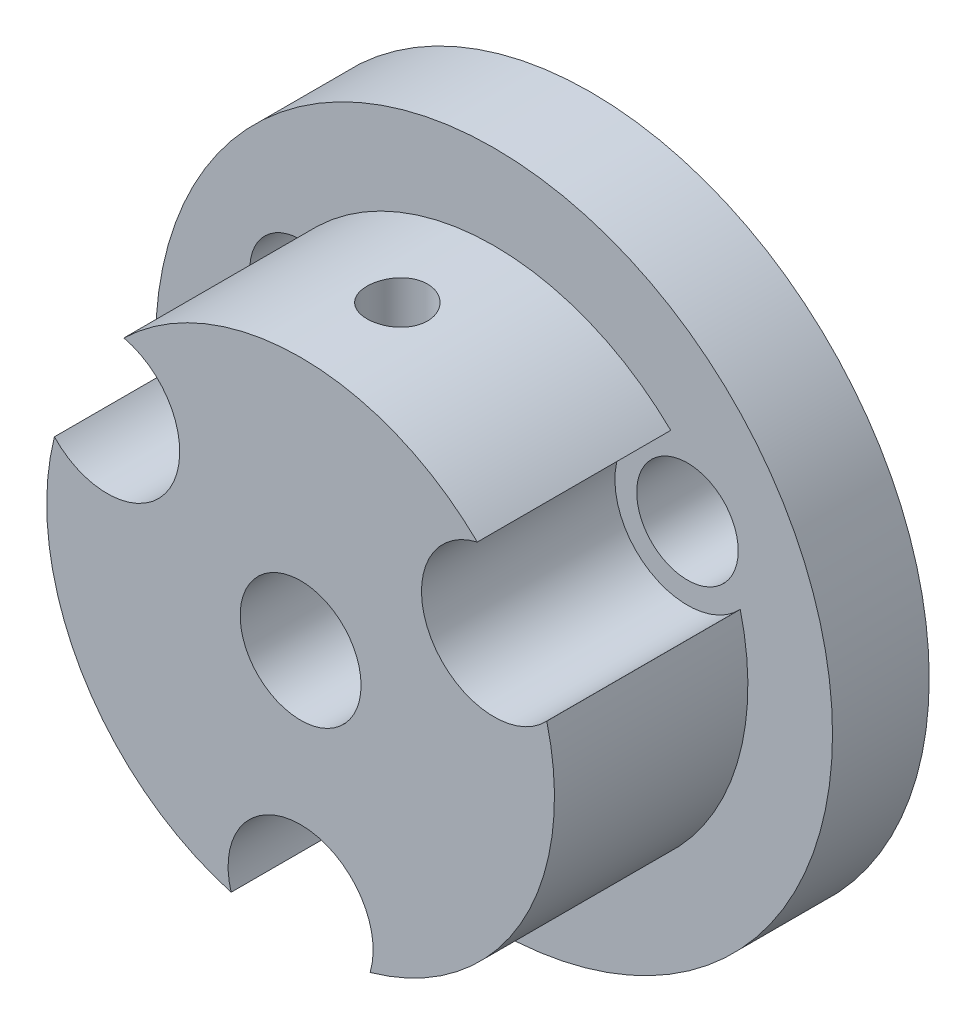
ISO-10303-21;
HEADER;
FILE_DESCRIPTION(('STEP AP214'),'2;1');
FILE_NAME('part.step','',(''),(''),'','','');
FILE_SCHEMA(('AUTOMOTIVE_DESIGN { 1 0 10303 214 1 1 1 1 }'));
ENDSEC;
DATA;
#1=APPLICATION_CONTEXT('core data for automotive mechanical design processes');
#2=APPLICATION_PROTOCOL_DEFINITION('international standard','automotive_design',2000,#1);
#3=PRODUCT_CONTEXT('',#1,'mechanical');
#4=PRODUCT('Part','Part','',(#3));
#5=PRODUCT_RELATED_PRODUCT_CATEGORY('part','',(#4));
#6=PRODUCT_DEFINITION_FORMATION('','',#4);
#7=PRODUCT_DEFINITION_CONTEXT('part definition',#1,'design');
#8=PRODUCT_DEFINITION('design','',#6,#7);
#9=PRODUCT_DEFINITION_SHAPE('','',#8);
#10=(LENGTH_UNIT() NAMED_UNIT(*) SI_UNIT(.MILLI.,.METRE.));
#11=(NAMED_UNIT(*) PLANE_ANGLE_UNIT() SI_UNIT($,.RADIAN.));
#12=(NAMED_UNIT(*) SI_UNIT($,.STERADIAN.) SOLID_ANGLE_UNIT());
#13=UNCERTAINTY_MEASURE_WITH_UNIT(LENGTH_MEASURE(1.E-05),#10,'distance_accuracy_value','');
#14=(GEOMETRIC_REPRESENTATION_CONTEXT(3) GLOBAL_UNCERTAINTY_ASSIGNED_CONTEXT((#13)) GLOBAL_UNIT_ASSIGNED_CONTEXT((#10,
#11,#12)) REPRESENTATION_CONTEXT('',''));
#15=CARTESIAN_POINT('',(0.,0.,0.));
#16=DIRECTION('',(0.,0.,1.));
#17=DIRECTION('',(1.,0.,0.));
#18=AXIS2_PLACEMENT_3D('',#15,#16,#17);
#19=CARTESIAN_POINT('',(0.,0.,12.));
#20=DIRECTION('',(0.,0.,-1.));
#21=DIRECTION('',(-1.,0.,0.));
#22=AXIS2_PLACEMENT_3D('',#19,#20,#21);
#23=CYLINDRICAL_SURFACE('',#22,10.5);
#24=CARTESIAN_POINT('',(0.,10.5,9.25));
#25=CARTESIAN_POINT('',(0.0699475936257036,10.4999990627842,9.24999701239163));
#26=CARTESIAN_POINT('',(0.139939552411775,10.4992936542632,9.24410901234132));
#27=CARTESIAN_POINT('',(0.277977687011594,10.4965474865238,9.22071252218055));
#28=CARTESIAN_POINT('',(0.346021722500156,10.4945053131663,9.20319172566545));
#29=CARTESIAN_POINT('',(0.478145498303041,10.4893157972216,9.15705156614751));
#30=CARTESIAN_POINT('',(0.542227804829418,10.4861691790509,9.12843947675372));
#31=CARTESIAN_POINT('',(0.66466833091937,10.4791212247497,9.0609443902961));
#32=CARTESIAN_POINT('',(0.723027569949896,10.4752200234047,9.02206322706676));
#33=CARTESIAN_POINT('',(0.832670643789314,10.4670769655502,8.9349250617949));
#34=CARTESIAN_POINT('',(0.883921662387477,10.4628336633326,8.8866268992024));
#35=CARTESIAN_POINT('',(0.977610976963137,10.4544963823019,8.78211401318015));
#36=CARTESIAN_POINT('',(1.02004883494707,10.4504024109186,8.72589889652909));
#37=CARTESIAN_POINT('',(1.095028024827,10.442812993205,8.6069363973964));
#38=CARTESIAN_POINT('',(1.12753885630509,10.4393194056245,8.54416966245442));
#39=CARTESIAN_POINT('',(1.18154636106757,10.4333451455293,8.41401897186602));
#40=CARTESIAN_POINT('',(1.20304341409852,10.4308644380919,8.34663517550314));
#41=CARTESIAN_POINT('',(1.2343139770195,10.427210471374,8.20950245156516));
#42=CARTESIAN_POINT('',(1.24414268336783,10.4260310582816,8.13976627731595));
#43=CARTESIAN_POINT('',(1.25196830460063,10.4250943297203,7.99962502717556));
#44=CARTESIAN_POINT('',(1.24996565258353,10.4253369621962,7.92921997586348));
#45=CARTESIAN_POINT('',(1.23423076047667,10.4272112802058,7.79012309974998));
#46=CARTESIAN_POINT('',(1.22055918252446,10.4288357818008,7.72142430221494));
#47=CARTESIAN_POINT('',(1.18196910557829,10.4332795911022,7.58730308522441));
#48=CARTESIAN_POINT('',(1.15705039813801,10.4360989209526,7.52188072651708));
#49=CARTESIAN_POINT('',(1.09660775872499,10.4426229004232,7.39598021422571));
#50=CARTESIAN_POINT('',(1.06105732345842,10.4463297578562,7.33551490347835));
#51=CARTESIAN_POINT('',(0.980379355086877,10.454209380908,7.22138555472782));
#52=CARTESIAN_POINT('',(0.935251424510862,10.4583821658596,7.16772179914041));
#53=CARTESIAN_POINT('',(0.836362613568929,10.4667554375842,7.06836667005418));
#54=CARTESIAN_POINT('',(0.782549419052806,10.4709559341264,7.02272734984492));
#55=CARTESIAN_POINT('',(0.667998156143297,10.4788868274356,6.9411214445485));
#56=CARTESIAN_POINT('',(0.607260074204236,10.482617223283,6.90515487838254));
#57=CARTESIAN_POINT('',(0.480544076472796,10.4891896165517,6.84391595124794));
#58=CARTESIAN_POINT('',(0.414564648499562,10.4920313564109,6.81864668996487));
#59=CARTESIAN_POINT('',(0.279257907490741,10.4965038535979,6.77956017555407));
#60=CARTESIAN_POINT('',(0.209930736672925,10.49813466232,6.76574243639849));
#61=CARTESIAN_POINT('',(0.0703467115396399,10.4999948911042,6.75001829717867));
#62=CARTESIAN_POINT('',(9.8046442172385E-05,10.5002327510227,6.74804015952726));
#63=CARTESIAN_POINT('',(-0.139729786983938,10.4993030290141,6.75586229088874));
#64=CARTESIAN_POINT('',(-0.209308968190918,10.4981354741764,6.76566233287559));
#65=CARTESIAN_POINT('',(-0.345612253176869,10.4945313993079,6.79670305971871));
#66=CARTESIAN_POINT('',(-0.412344218888418,10.4920986563667,6.81790969776851));
#67=CARTESIAN_POINT('',(-0.541304351441906,10.4862367019395,6.87112634657761));
#68=CARTESIAN_POINT('',(-0.603532378350753,10.4828074595098,6.90313669282302));
#69=CARTESIAN_POINT('',(-0.722039619689205,10.475314092816,6.97722678515942));
#70=CARTESIAN_POINT('',(-0.778289517743096,10.4712470619883,7.019353123917));
#71=CARTESIAN_POINT('',(-0.882945896591943,10.4629426023161,7.11241324556918));
#72=CARTESIAN_POINT('',(-0.931352095837293,10.4587051673618,7.16334734448277));
#73=CARTESIAN_POINT('',(-1.01920013053021,10.4505116070986,7.27289239931917));
#74=CARTESIAN_POINT('',(-1.05859453215799,10.4465570423548,7.3315415276793));
#75=CARTESIAN_POINT('',(-1.12697343538891,10.4394021806389,7.45466579676053));
#76=CARTESIAN_POINT('',(-1.1559581291145,10.4362018697466,7.51914082993076));
#77=CARTESIAN_POINT('',(-1.20261737504819,10.4309283013044,7.65193117505654));
#78=CARTESIAN_POINT('',(-1.22031905097623,10.428852342698,7.7202368445951));
#79=CARTESIAN_POINT('',(-1.24399730384296,10.4260546317578,7.85887729984685));
#80=CARTESIAN_POINT('',(-1.24997437162882,10.4253328227328,7.92921200049017));
#81=CARTESIAN_POINT('',(-1.25002530446505,10.4253266782152,8.06944220654871));
#82=CARTESIAN_POINT('',(-1.24417368461885,10.4260333440108,8.1393376962701));
#83=CARTESIAN_POINT('',(-1.22089074117631,10.4287852211255,8.27714444822099));
#84=CARTESIAN_POINT('',(-1.203459412903,10.4308304329852,8.34505570964907));
#85=CARTESIAN_POINT('',(-1.15753447936189,10.4360262503539,8.47695879200294));
#86=CARTESIAN_POINT('',(-1.12904411028888,10.4391765324615,8.54095175320004));
#87=CARTESIAN_POINT('',(-1.06181720649907,10.4462281008657,8.66326030894175));
#88=CARTESIAN_POINT('',(-1.02308059078149,10.4501293930993,8.72157585859912));
#89=CARTESIAN_POINT('',(-0.936183292450618,10.4582728662952,8.83125549576418));
#90=CARTESIAN_POINT('',(-0.887967041394298,10.4625169658764,8.88257541748632));
#91=CARTESIAN_POINT('',(-0.783594116933044,10.4708507347895,8.97642519949858));
#92=CARTESIAN_POINT('',(-0.727435567034713,10.474940367336,9.01895297664336));
#93=CARTESIAN_POINT('',(-0.608551206498431,10.4825198643928,9.09413467221009));
#94=CARTESIAN_POINT('',(-0.545803334548258,10.4860076036383,9.12675390002054));
#95=CARTESIAN_POINT('',(-0.415715413547213,10.4919685079047,9.18094662530933));
#96=CARTESIAN_POINT('',(-0.348380495491786,10.4944427855194,9.20253224214919));
#97=CARTESIAN_POINT('',(-0.233907011424427,10.4974949723986,9.22882212432574));
#98=CARTESIAN_POINT('',(-0.187493055138751,10.4984298322677,9.2367525610369));
#99=CARTESIAN_POINT('',(-0.0940594180934241,10.4996826592135,9.24734248642352));
#100=CARTESIAN_POINT('',(-0.047039741250646,10.5000006302774,9.25000200916597));
#101=CARTESIAN_POINT('',(0.,10.5,9.25));
#102=B_SPLINE_CURVE_WITH_KNOTS('',3,(#24,#25,#26,#27,#28,#29,#30,#31,#32,#33,#34,#35,#36,#37,
#38,#39,#40,#41,#42,#43,#44,#45,#46,#47,#48,#49,#50,#51,#52,#53,#54,#55,#56,#57,#58,#59,#60,#61,
#62,#63,#64,#65,#66,#67,#68,#69,#70,#71,#72,#73,#74,#75,#76,#77,#78,#79,#80,#81,#82,#83,#84,#85,
#86,#87,#88,#89,#90,#91,#92,#93,#94,#95,#96,#97,#98,#99,#100,#101),.UNSPECIFIED.,.T.,.F.,(4,2,2,
2,2,2,2,2,2,2,2,2,2,2,2,2,2,2,2,2,2,2,2,2,2,2,2,2,2,2,2,2,2,2,2,2,2,2,4),(0.,0.209670972720522,
0.419564111794909,0.629319836330188,0.839038128326749,1.0496944982983,1.26036133489693,
1.47166907137088,1.68296952162715,1.89326639277702,2.1035555658522,2.31275814095642,
2.52196459343217,2.73169697596686,2.94143806420732,3.1524931803968,3.36354870943535,
3.57466535281384,3.78577303547733,3.99560028550367,4.20542349114571,4.41462385667016,
4.6238307190633,4.83402028823105,5.04421740048386,5.25549666119308,5.46677202231432,
5.67753755492196,5.88829426370587,6.0977274432329,6.30716070734883,6.51653273138812,
6.72590641064845,6.93654611554211,7.14723567078847,7.35865458351161,7.56984077114535,
7.71084536529433,7.85184904809894),.UNSPECIFIED.);
#103=CARTESIAN_POINT('',(0.,10.5,9.25));
#104=VERTEX_POINT('',#103);
#105=EDGE_CURVE('E233',#104,#104,#102,.T.);
#106=ORIENTED_EDGE('',*,*,#105,.F.);
#107=EDGE_LOOP('',(#106));
#108=FACE_BOUND('',#107,.T.);
#109=CARTESIAN_POINT('',(0.,0.,4.));
#110=DIRECTION('',(0.,0.,1.));
#111=DIRECTION('',(1.,0.,0.));
#112=AXIS2_PLACEMENT_3D('',#109,#110,#111);
#113=CIRCLE('',#112,10.5);
#114=CARTESIAN_POINT('',(7.30927502840114,7.53820260799559,4.));
#115=VERTEX_POINT('',#114);
#116=CARTESIAN_POINT('',(-7.30927502840114,7.53820260799559,4.));
#117=VERTEX_POINT('',#116);
#118=EDGE_CURVE('E11',#115,#117,#113,.T.);
#119=ORIENTED_EDGE('',*,*,#118,.T.);
#120=DIRECTION('',(0.,0.,-1.));
#121=VECTOR('',#120,1.);
#122=CARTESIAN_POINT('',(-7.30927502840114,7.53820260799559,8.));
#123=LINE('',#122,#121);
#124=CARTESIAN_POINT('',(-7.30927502840114,7.53820260799559,12.));
#125=VERTEX_POINT('',#124);
#126=EDGE_CURVE('E94',#125,#117,#123,.T.);
#127=ORIENTED_EDGE('',*,*,#126,.F.);
#128=CARTESIAN_POINT('',(0.,0.,12.));
#129=DIRECTION('',(0.,0.,1.));
#130=DIRECTION('',(1.,0.,0.));
#131=AXIS2_PLACEMENT_3D('',#128,#129,#130);
#132=CIRCLE('',#131,10.5);
#133=CARTESIAN_POINT('',(7.30927502840115,7.53820260799558,12.));
#134=VERTEX_POINT('',#133);
#135=EDGE_CURVE('E116',#134,#125,#132,.T.);
#136=ORIENTED_EDGE('',*,*,#135,.F.);
#137=DIRECTION('',(0.,0.,-1.));
#138=VECTOR('',#137,1.);
#139=CARTESIAN_POINT('',(7.30927502840114,7.53820260799559,8.));
#140=LINE('',#139,#138);
#141=EDGE_CURVE('E192',#115,#134,#140,.F.);
#142=ORIENTED_EDGE('',*,*,#141,.F.);
#143=EDGE_LOOP('',(#119,#127,#136,#142));
#144=FACE_BOUND('',#143,.T.);
#145=ADVANCED_FACE('F37',(#108,#144),#23,.T.);
#146=CARTESIAN_POINT('',(-10.1829124715989,2.56091655384483,12.));
#147=VERTEX_POINT('',#146);
#148=CARTESIAN_POINT('',(-2.87363744319772,-10.0991191618404,12.));
#149=VERTEX_POINT('',#148);
#150=EDGE_CURVE('E106',#147,#149,#132,.T.);
#151=ORIENTED_EDGE('',*,*,#150,.F.);
#152=DIRECTION('',(0.,0.,-1.));
#153=VECTOR('',#152,1.);
#154=CARTESIAN_POINT('',(-10.1829124715989,2.56091655384482,8.));
#155=LINE('',#154,#153);
#156=CARTESIAN_POINT('',(-10.1829124715989,2.56091655384482,4.));
#157=VERTEX_POINT('',#156);
#158=EDGE_CURVE('E63',#157,#147,#155,.F.);
#159=ORIENTED_EDGE('',*,*,#158,.F.);
#160=CARTESIAN_POINT('',(-2.87363744319772,-10.0991191618404,4.));
#161=VERTEX_POINT('',#160);
#162=EDGE_CURVE('E46',#157,#161,#113,.T.);
#163=ORIENTED_EDGE('',*,*,#162,.T.);
#164=DIRECTION('',(0.,0.,-1.));
#165=VECTOR('',#164,1.);
#166=CARTESIAN_POINT('',(-2.87363744319772,-10.0991191618404,8.));
#167=LINE('',#166,#165);
#168=EDGE_CURVE('E201',#149,#161,#167,.T.);
#169=ORIENTED_EDGE('',*,*,#168,.F.);
#170=EDGE_LOOP('',(#151,#159,#163,#169));
#171=FACE_BOUND('',#170,.T.);
#172=ADVANCED_FACE('F103',(#171),#23,.T.);
#173=CARTESIAN_POINT('',(0.,0.,4.));
#174=DIRECTION('',(0.,0.,-1.));
#175=DIRECTION('',(-1.,0.,0.));
#176=AXIS2_PLACEMENT_3D('',#173,#174,#175);
#177=CYLINDRICAL_SURFACE('',#176,14.);
#178=CARTESIAN_POINT('',(0.,0.,4.));
#179=DIRECTION('',(0.,0.,1.));
#180=DIRECTION('',(1.,0.,0.));
#181=AXIS2_PLACEMENT_3D('',#178,#179,#180);
#182=CIRCLE('',#181,14.);
#183=CARTESIAN_POINT('',(14.,0.,4.));
#184=VERTEX_POINT('',#183);
#185=EDGE_CURVE('E113',#184,#184,#182,.T.);
#186=ORIENTED_EDGE('',*,*,#185,.F.);
#187=EDGE_LOOP('',(#186));
#188=FACE_BOUND('',#187,.T.);
#189=CARTESIAN_POINT('',(0.,0.,0.));
#190=DIRECTION('',(0.,0.,1.));
#191=DIRECTION('',(1.,0.,0.));
#192=AXIS2_PLACEMENT_3D('',#189,#190,#191);
#193=CIRCLE('',#192,14.);
#194=CARTESIAN_POINT('',(14.,0.,0.));
#195=VERTEX_POINT('',#194);
#196=EDGE_CURVE('E41',#195,#195,#193,.T.);
#197=ORIENTED_EDGE('',*,*,#196,.T.);
#198=EDGE_LOOP('',(#197));
#199=FACE_BOUND('',#198,.T.);
#200=ADVANCED_FACE('F39',(#188,#199),#177,.T.);
#201=CARTESIAN_POINT('',(0.,0.,4.));
#202=DIRECTION('',(0.,0.,1.));
#203=DIRECTION('',(1.,0.,0.));
#204=AXIS2_PLACEMENT_3D('',#201,#202,#203);
#205=PLANE('',#204);
#206=CARTESIAN_POINT('',(-8.,4.61880215351701,4.));
#207=DIRECTION('',(0.,0.,1.));
#208=DIRECTION('',(1.,0.,0.));
#209=AXIS2_PLACEMENT_3D('',#206,#207,#208);
#210=CIRCLE('',#209,2.1);
#211=CARTESIAN_POINT('',(-5.9,4.61880215351701,4.));
#212=VERTEX_POINT('',#211);
#213=EDGE_CURVE('E121',#212,#212,#210,.T.);
#214=ORIENTED_EDGE('',*,*,#213,.F.);
#215=EDGE_LOOP('',(#214));
#216=FACE_BOUND('',#215,.T.);
#217=CARTESIAN_POINT('',(2.87363744319772,-10.0991191618404,4.));
#218=VERTEX_POINT('',#217);
#219=CARTESIAN_POINT('',(10.1829124715989,2.56091655384482,4.));
#220=VERTEX_POINT('',#219);
#221=EDGE_CURVE('E48',#218,#220,#113,.T.);
#222=ORIENTED_EDGE('',*,*,#221,.F.);
#223=CARTESIAN_POINT('',(0.,-9.23760430703402,4.));
#224=DIRECTION('',(0.,0.,-1.));
#225=DIRECTION('',(-1.,0.,0.));
#226=AXIS2_PLACEMENT_3D('',#223,#224,#225);
#227=CIRCLE('',#226,3.);
#228=EDGE_CURVE('E111',#161,#218,#227,.T.);
#229=ORIENTED_EDGE('',*,*,#228,.F.);
#230=ORIENTED_EDGE('',*,*,#162,.F.);
#231=CARTESIAN_POINT('',(-8.,4.61880215351701,4.));
#232=DIRECTION('',(0.,0.,-1.));
#233=DIRECTION('',(-1.,0.,0.));
#234=AXIS2_PLACEMENT_3D('',#231,#232,#233);
#235=CIRCLE('',#234,3.);
#236=EDGE_CURVE('E91',#117,#157,#235,.T.);
#237=ORIENTED_EDGE('',*,*,#236,.F.);
#238=ORIENTED_EDGE('',*,*,#118,.F.);
#239=CARTESIAN_POINT('',(8.,4.61880215351701,4.));
#240=DIRECTION('',(0.,0.,-1.));
#241=DIRECTION('',(-1.,0.,0.));
#242=AXIS2_PLACEMENT_3D('',#239,#240,#241);
#243=CIRCLE('',#242,3.);
#244=EDGE_CURVE('E188',#220,#115,#243,.T.);
#245=ORIENTED_EDGE('',*,*,#244,.F.);
#246=EDGE_LOOP('',(#222,#229,#230,#237,#238,#245));
#247=FACE_BOUND('',#246,.T.);
#248=CARTESIAN_POINT('',(0.,-9.23760430703402,4.));
#249=DIRECTION('',(0.,0.,1.));
#250=DIRECTION('',(1.,0.,0.));
#251=AXIS2_PLACEMENT_3D('',#248,#249,#250);
#252=CIRCLE('',#251,2.1);
#253=CARTESIAN_POINT('',(2.1,-9.23760430703402,4.));
#254=VERTEX_POINT('',#253);
#255=EDGE_CURVE('E128',#254,#254,#252,.T.);
#256=ORIENTED_EDGE('',*,*,#255,.F.);
#257=EDGE_LOOP('',(#256));
#258=FACE_BOUND('',#257,.T.);
#259=CARTESIAN_POINT('',(8.,4.61880215351701,4.));
#260=DIRECTION('',(0.,0.,1.));
#261=DIRECTION('',(1.,0.,0.));
#262=AXIS2_PLACEMENT_3D('',#259,#260,#261);
#263=CIRCLE('',#262,2.1);
#264=CARTESIAN_POINT('',(10.1,4.61880215351701,4.));
#265=VERTEX_POINT('',#264);
#266=EDGE_CURVE('E122',#265,#265,#263,.T.);
#267=ORIENTED_EDGE('',*,*,#266,.F.);
#268=EDGE_LOOP('',(#267));
#269=FACE_BOUND('',#268,.T.);
#270=ORIENTED_EDGE('',*,*,#185,.T.);
#271=EDGE_LOOP('',(#270));
#272=FACE_BOUND('',#271,.T.);
#273=ADVANCED_FACE('F109',(#216,#247,#258,#269,#272),#205,.T.);
#274=CARTESIAN_POINT('',(0.,0.,0.));
#275=DIRECTION('',(0.,0.,1.));
#276=DIRECTION('',(1.,0.,0.));
#277=AXIS2_PLACEMENT_3D('',#274,#275,#276);
#278=PLANE('',#277);
#279=CARTESIAN_POINT('',(0.,0.,0.));
#280=DIRECTION('',(0.,0.,1.));
#281=DIRECTION('',(1.,0.,0.));
#282=AXIS2_PLACEMENT_3D('',#279,#280,#281);
#283=CIRCLE('',#282,2.5);
#284=CARTESIAN_POINT('',(2.5,0.,0.));
#285=VERTEX_POINT('',#284);
#286=EDGE_CURVE('E203',#285,#285,#283,.T.);
#287=ORIENTED_EDGE('',*,*,#286,.T.);
#288=EDGE_LOOP('',(#287));
#289=FACE_BOUND('',#288,.T.);
#290=CARTESIAN_POINT('',(8.,4.61880215351701,0.));
#291=DIRECTION('',(0.,0.,1.));
#292=DIRECTION('',(1.,0.,0.));
#293=AXIS2_PLACEMENT_3D('',#290,#291,#292);
#294=CIRCLE('',#293,2.1);
#295=CARTESIAN_POINT('',(10.1,4.61880215351701,0.));
#296=VERTEX_POINT('',#295);
#297=EDGE_CURVE('E118',#296,#296,#294,.T.);
#298=ORIENTED_EDGE('',*,*,#297,.T.);
#299=EDGE_LOOP('',(#298));
#300=FACE_BOUND('',#299,.T.);
#301=CARTESIAN_POINT('',(0.,-9.23760430703402,0.));
#302=DIRECTION('',(0.,0.,1.));
#303=DIRECTION('',(1.,0.,0.));
#304=AXIS2_PLACEMENT_3D('',#301,#302,#303);
#305=CIRCLE('',#304,2.1);
#306=CARTESIAN_POINT('',(2.1,-9.23760430703402,0.));
#307=VERTEX_POINT('',#306);
#308=EDGE_CURVE('E125',#307,#307,#305,.T.);
#309=ORIENTED_EDGE('',*,*,#308,.T.);
#310=EDGE_LOOP('',(#309));
#311=FACE_BOUND('',#310,.T.);
#312=CARTESIAN_POINT('',(-8.,4.61880215351701,0.));
#313=DIRECTION('',(0.,0.,1.));
#314=DIRECTION('',(1.,0.,0.));
#315=AXIS2_PLACEMENT_3D('',#312,#313,#314);
#316=CIRCLE('',#315,2.1);
#317=CARTESIAN_POINT('',(-5.9,4.61880215351701,0.));
#318=VERTEX_POINT('',#317);
#319=EDGE_CURVE('E131',#318,#318,#316,.T.);
#320=ORIENTED_EDGE('',*,*,#319,.T.);
#321=EDGE_LOOP('',(#320));
#322=FACE_BOUND('',#321,.T.);
#323=ORIENTED_EDGE('',*,*,#196,.F.);
#324=EDGE_LOOP('',(#323));
#325=FACE_BOUND('',#324,.T.);
#326=ADVANCED_FACE('F142',(#289,#300,#311,#322,#325),#278,.F.);
#327=CARTESIAN_POINT('',(-8.,4.61880215351701,0.));
#328=DIRECTION('',(0.,0.,1.));
#329=DIRECTION('',(1.,0.,0.));
#330=AXIS2_PLACEMENT_3D('',#327,#328,#329);
#331=CYLINDRICAL_SURFACE('',#330,2.1);
#332=ORIENTED_EDGE('',*,*,#319,.F.);
#333=EDGE_LOOP('',(#332));
#334=FACE_BOUND('',#333,.T.);
#335=ORIENTED_EDGE('',*,*,#213,.T.);
#336=EDGE_LOOP('',(#335));
#337=FACE_BOUND('',#336,.T.);
#338=ADVANCED_FACE('F144',(#334,#337),#331,.F.);
#339=CARTESIAN_POINT('',(0.,-9.23760430703402,0.));
#340=DIRECTION('',(0.,0.,1.));
#341=DIRECTION('',(1.,0.,0.));
#342=AXIS2_PLACEMENT_3D('',#339,#340,#341);
#343=CYLINDRICAL_SURFACE('',#342,2.1);
#344=ORIENTED_EDGE('',*,*,#308,.F.);
#345=EDGE_LOOP('',(#344));
#346=FACE_BOUND('',#345,.T.);
#347=ORIENTED_EDGE('',*,*,#255,.T.);
#348=EDGE_LOOP('',(#347));
#349=FACE_BOUND('',#348,.T.);
#350=ADVANCED_FACE('F150',(#346,#349),#343,.F.);
#351=CARTESIAN_POINT('',(8.,4.61880215351701,0.));
#352=DIRECTION('',(0.,0.,1.));
#353=DIRECTION('',(1.,0.,0.));
#354=AXIS2_PLACEMENT_3D('',#351,#352,#353);
#355=CYLINDRICAL_SURFACE('',#354,2.1);
#356=ORIENTED_EDGE('',*,*,#297,.F.);
#357=EDGE_LOOP('',(#356));
#358=FACE_BOUND('',#357,.T.);
#359=ORIENTED_EDGE('',*,*,#266,.T.);
#360=EDGE_LOOP('',(#359));
#361=FACE_BOUND('',#360,.T.);
#362=ADVANCED_FACE('F170',(#358,#361),#355,.F.);
#363=CARTESIAN_POINT('',(2.87363744319772,-10.0991191618404,12.));
#364=VERTEX_POINT('',#363);
#365=CARTESIAN_POINT('',(10.1829124715989,2.56091655384483,12.));
#366=VERTEX_POINT('',#365);
#367=EDGE_CURVE('E181',#364,#366,#132,.T.);
#368=ORIENTED_EDGE('',*,*,#367,.F.);
#369=DIRECTION('',(0.,0.,-1.));
#370=VECTOR('',#369,1.);
#371=CARTESIAN_POINT('',(2.87363744319772,-10.0991191618404,8.));
#372=LINE('',#371,#370);
#373=EDGE_CURVE('E55',#218,#364,#372,.F.);
#374=ORIENTED_EDGE('',*,*,#373,.F.);
#375=ORIENTED_EDGE('',*,*,#221,.T.);
#376=DIRECTION('',(0.,0.,-1.));
#377=VECTOR('',#376,1.);
#378=CARTESIAN_POINT('',(10.1829124715989,2.56091655384482,8.));
#379=LINE('',#378,#377);
#380=EDGE_CURVE('E183',#366,#220,#379,.T.);
#381=ORIENTED_EDGE('',*,*,#380,.F.);
#382=EDGE_LOOP('',(#368,#374,#375,#381));
#383=FACE_BOUND('',#382,.T.);
#384=ADVANCED_FACE('F160',(#383),#23,.T.);
#385=CARTESIAN_POINT('',(0.,0.,12.));
#386=DIRECTION('',(0.,0.,1.));
#387=DIRECTION('',(1.,0.,0.));
#388=AXIS2_PLACEMENT_3D('',#385,#386,#387);
#389=PLANE('',#388);
#390=CARTESIAN_POINT('',(0.,0.,12.));
#391=DIRECTION('',(0.,0.,1.));
#392=DIRECTION('',(1.,0.,0.));
#393=AXIS2_PLACEMENT_3D('',#390,#391,#392);
#394=CIRCLE('',#393,2.5);
#395=CARTESIAN_POINT('',(2.5,0.,12.));
#396=VERTEX_POINT('',#395);
#397=EDGE_CURVE('E197',#396,#396,#394,.T.);
#398=ORIENTED_EDGE('',*,*,#397,.F.);
#399=EDGE_LOOP('',(#398));
#400=FACE_BOUND('',#399,.T.);
#401=CARTESIAN_POINT('',(-8.,4.61880215351701,12.));
#402=DIRECTION('',(0.,0.,1.));
#403=DIRECTION('',(1.,0.,0.));
#404=AXIS2_PLACEMENT_3D('',#401,#402,#403);
#405=CIRCLE('',#404,3.);
#406=EDGE_CURVE('E98',#125,#147,#405,.F.);
#407=ORIENTED_EDGE('',*,*,#406,.T.);
#408=ORIENTED_EDGE('',*,*,#150,.T.);
#409=CARTESIAN_POINT('',(0.,-9.23760430703402,12.));
#410=DIRECTION('',(0.,0.,1.));
#411=DIRECTION('',(1.,0.,0.));
#412=AXIS2_PLACEMENT_3D('',#409,#410,#411);
#413=CIRCLE('',#412,3.);
#414=EDGE_CURVE('E193',#149,#364,#413,.F.);
#415=ORIENTED_EDGE('',*,*,#414,.T.);
#416=ORIENTED_EDGE('',*,*,#367,.T.);
#417=CARTESIAN_POINT('',(8.,4.61880215351701,12.));
#418=DIRECTION('',(0.,0.,1.));
#419=DIRECTION('',(1.,0.,0.));
#420=AXIS2_PLACEMENT_3D('',#417,#418,#419);
#421=CIRCLE('',#420,3.);
#422=EDGE_CURVE('E187',#366,#134,#421,.F.);
#423=ORIENTED_EDGE('',*,*,#422,.T.);
#424=ORIENTED_EDGE('',*,*,#135,.T.);
#425=EDGE_LOOP('',(#407,#408,#415,#416,#423,#424));
#426=FACE_BOUND('',#425,.T.);
#427=ADVANCED_FACE('F169',(#400,#426),#389,.T.);
#428=CARTESIAN_POINT('',(8.,4.61880215351701,12.001));
#429=DIRECTION('',(0.,0.,-1.));
#430=DIRECTION('',(-1.,0.,0.));
#431=AXIS2_PLACEMENT_3D('',#428,#429,#430);
#432=CYLINDRICAL_SURFACE('',#431,3.);
#433=ORIENTED_EDGE('',*,*,#141,.T.);
#434=ORIENTED_EDGE('',*,*,#422,.F.);
#435=ORIENTED_EDGE('',*,*,#380,.T.);
#436=ORIENTED_EDGE('',*,*,#244,.T.);
#437=EDGE_LOOP('',(#433,#434,#435,#436));
#438=FACE_BOUND('',#437,.T.);
#439=ADVANCED_FACE('F176',(#438),#432,.F.);
#440=CARTESIAN_POINT('',(0.,-9.23760430703402,12.001));
#441=DIRECTION('',(0.,0.,-1.));
#442=DIRECTION('',(-1.,0.,0.));
#443=AXIS2_PLACEMENT_3D('',#440,#441,#442);
#444=CYLINDRICAL_SURFACE('',#443,3.);
#445=ORIENTED_EDGE('',*,*,#373,.T.);
#446=ORIENTED_EDGE('',*,*,#414,.F.);
#447=ORIENTED_EDGE('',*,*,#168,.T.);
#448=ORIENTED_EDGE('',*,*,#228,.T.);
#449=EDGE_LOOP('',(#445,#446,#447,#448));
#450=FACE_BOUND('',#449,.T.);
#451=ADVANCED_FACE('F211',(#450),#444,.F.);
#452=CARTESIAN_POINT('',(-8.,4.61880215351701,12.001));
#453=DIRECTION('',(0.,0.,-1.));
#454=DIRECTION('',(-1.,0.,0.));
#455=AXIS2_PLACEMENT_3D('',#452,#453,#454);
#456=CYLINDRICAL_SURFACE('',#455,3.);
#457=ORIENTED_EDGE('',*,*,#158,.T.);
#458=ORIENTED_EDGE('',*,*,#406,.F.);
#459=ORIENTED_EDGE('',*,*,#126,.T.);
#460=ORIENTED_EDGE('',*,*,#236,.T.);
#461=EDGE_LOOP('',(#457,#458,#459,#460));
#462=FACE_BOUND('',#461,.T.);
#463=ADVANCED_FACE('F92',(#462),#456,.F.);
#464=CARTESIAN_POINT('',(0.,0.,0.));
#465=DIRECTION('',(0.,0.,1.));
#466=DIRECTION('',(1.,0.,0.));
#467=AXIS2_PLACEMENT_3D('',#464,#465,#466);
#468=CYLINDRICAL_SURFACE('',#467,2.5);
#469=CARTESIAN_POINT('',(0.,2.5,9.25));
#470=CARTESIAN_POINT('',(-0.0657149536912332,2.49999641755189,9.24999587210063));
#471=CARTESIAN_POINT('',(-0.131508249622541,2.49738113774397,9.24478740859791));
#472=CARTESIAN_POINT('',(-0.261150294085532,2.48717695046745,9.22418389957385));
#473=CARTESIAN_POINT('',(-0.32499510839188,2.47957859786229,9.20876950875294));
#474=CARTESIAN_POINT('',(-0.448666931100719,2.46020349254139,9.16850773922901));
#475=CARTESIAN_POINT('',(-0.508508503673976,2.448442989719,9.14369701968998));
#476=CARTESIAN_POINT('',(-0.623090771008207,2.42182220644723,9.08553672329382));
#477=CARTESIAN_POINT('',(-0.677831867487564,2.40696217041912,9.05218781968894));
#478=CARTESIAN_POINT('',(-0.7843847722024,2.37445322822571,8.97560343814338));
#479=CARTESIAN_POINT('',(-0.835819013902641,2.3566899890942,8.93189190095045));
#480=CARTESIAN_POINT('',(-0.930974306083723,2.3207496280843,8.83684815094121));
#481=CARTESIAN_POINT('',(-0.974689478883459,2.30257220261294,8.78551018528445));
#482=CARTESIAN_POINT('',(-1.05656500056285,2.26623688996684,8.67189581309577));
#483=CARTESIAN_POINT('',(-1.09403166943955,2.24818983712665,8.60907987706761));
#484=CARTESIAN_POINT('',(-1.15771028361337,2.21607473465401,8.47704083001723));
#485=CARTESIAN_POINT('',(-1.18393026870792,2.20200384508737,8.40782233909656));
#486=CARTESIAN_POINT('',(-1.22266555273574,2.18072333797261,8.2691686182226));
#487=CARTESIAN_POINT('',(-1.23590732135055,2.17315339479642,8.19999443491576));
#488=CARTESIAN_POINT('',(-1.25053374163606,2.1647736243566,8.06002645277565));
#489=CARTESIAN_POINT('',(-1.25193011046634,2.1639571167911,7.98923432391106));
#490=CARTESIAN_POINT('',(-1.24335910896537,2.1688866282156,7.85714246960579));
#491=CARTESIAN_POINT('',(-1.23473069942103,2.17385954577517,7.79571996097119));
#492=CARTESIAN_POINT('',(-1.20867481132117,2.18845285917313,7.6753476132837));
#493=CARTESIAN_POINT('',(-1.19124452987207,2.1980747353972,7.61639856836836));
#494=CARTESIAN_POINT('',(-1.14776222548251,2.22109345515926,7.50096358429293));
#495=CARTESIAN_POINT('',(-1.12151883389499,2.23457300829998,7.44456700151776));
#496=CARTESIAN_POINT('',(-1.061302109585,2.26379255351755,7.33670713426249));
#497=CARTESIAN_POINT('',(-1.02732530476558,2.27953355975238,7.28524608049989));
#498=CARTESIAN_POINT('',(-0.947582568640986,2.31391447379107,7.18184843407097));
#499=CARTESIAN_POINT('',(-0.900868072961603,2.33266887795933,7.1306789080298));
#500=CARTESIAN_POINT('',(-0.799444473426718,2.36934529125509,7.03658072676137));
#501=CARTESIAN_POINT('',(-0.744731570717858,2.38726689948501,6.99365600995765));
#502=CARTESIAN_POINT('',(-0.625645632289812,2.42127484103705,6.91539292371284));
#503=CARTESIAN_POINT('',(-0.560941989499263,2.43723730202509,6.88049940944282));
#504=CARTESIAN_POINT('',(-0.425582769360998,2.46447351401553,6.82237871369624));
#505=CARTESIAN_POINT('',(-0.354931970331597,2.47575098679441,6.79914226873104));
#506=CARTESIAN_POINT('',(-0.215958114575879,2.49155417176795,6.76690574535416));
#507=CARTESIAN_POINT('',(-0.147926913185407,2.4965617287664,6.75688595531653));
#508=CARTESIAN_POINT('',(-0.0109744999366933,2.50091266823877,6.74816908608189));
#509=CARTESIAN_POINT('',(0.0579462748373757,2.5002587340164,6.74946664295065));
#510=CARTESIAN_POINT('',(0.189041214982491,2.49363990316801,6.76275836052344));
#511=CARTESIAN_POINT('',(0.251324260062442,2.48809057110237,6.77391566591254));
#512=CARTESIAN_POINT('',(0.373008615377396,2.47277714143524,6.80529758986886));
#513=CARTESIAN_POINT('',(0.432409607113746,2.46301257917916,6.8255232080667));
#514=CARTESIAN_POINT('',(0.548610760562082,2.43980314267087,6.87499808304146));
#515=CARTESIAN_POINT('',(0.605287996257693,2.42626102212424,6.90448881264602));
#516=CARTESIAN_POINT('',(0.713076702123652,2.39679967896386,6.97138441955755));
#517=CARTESIAN_POINT('',(0.764185787219103,2.38087944457231,7.00879266824179));
#518=CARTESIAN_POINT('',(0.864709611613318,2.3463527667183,7.09470053166609));
#519=CARTESIAN_POINT('',(0.9134650972808,2.32763606060552,7.14392858556696));
#520=CARTESIAN_POINT('',(1.00232040139155,2.29077989504843,7.24990643908663));
#521=CARTESIAN_POINT('',(1.04241423211355,2.27264084226908,7.30666139852047));
#522=CARTESIAN_POINT('',(1.11463489312212,2.23813990282585,7.42955456775039));
#523=CARTESIAN_POINT('',(1.1462818698483,2.2219066207934,7.49601408276074));
#524=CARTESIAN_POINT('',(1.19760353251725,2.19467590460158,7.63438758461565));
#525=CARTESIAN_POINT('',(1.21729364485946,2.18367172800773,7.70629440812649));
#526=CARTESIAN_POINT('',(1.2423271093121,2.16951876260833,7.84613777857681));
#527=CARTESIAN_POINT('',(1.24886624550108,2.16571729325614,7.9137928167863));
#528=CARTESIAN_POINT('',(1.25086144297598,2.16456693307719,8.04930883396341));
#529=CARTESIAN_POINT('',(1.2463223082805,2.16721524534441,8.11716971092429));
#530=CARTESIAN_POINT('',(1.22740765699033,2.17797327562531,8.24435437691502));
#531=CARTESIAN_POINT('',(1.2140103929285,2.18553868102992,8.3038755876805));
#532=CARTESIAN_POINT('',(1.17896919778081,2.20463770234897,8.41976014928088));
#533=CARTESIAN_POINT('',(1.15732261394976,2.21617259462094,8.47612247761496));
#534=CARTESIAN_POINT('',(1.10476968162586,2.2428566295566,8.58828106373326));
#535=CARTESIAN_POINT('',(1.07333892227057,2.25819652995238,8.64378487728712));
#536=CARTESIAN_POINT('',(1.0026887145458,2.29044164543238,8.74909317022573));
#537=CARTESIAN_POINT('',(0.963465214048313,2.30734767243152,8.79889466314811));
#538=CARTESIAN_POINT('',(0.872754158330804,2.34327903949141,8.89767747794702));
#539=CARTESIAN_POINT('',(0.820355528762717,2.36231229139336,8.9458238779524));
#540=CARTESIAN_POINT('',(0.707693507775352,2.3984719031886,9.03282872927954));
#541=CARTESIAN_POINT('',(0.647425904070984,2.4155972326005,9.07168217428286));
#542=CARTESIAN_POINT('',(0.519914496024936,2.44622511981379,9.13904545345275));
#543=CARTESIAN_POINT('',(0.45262437991827,2.45970120703636,9.16748021176429));
#544=CARTESIAN_POINT('',(0.313427626617741,2.48126676704332,9.21226020989869));
#545=CARTESIAN_POINT('',(0.24153474952896,2.48937154216165,9.22863980853697));
#546=CARTESIAN_POINT('',(0.140752433104231,2.49619327387079,9.24237176384481));
#547=CARTESIAN_POINT('',(0.112702349299375,2.49761706674002,9.24522830107952));
#548=CARTESIAN_POINT('',(0.0564396647589481,2.49952121222331,9.24904333189601));
#549=CARTESIAN_POINT('',(0.0282270595592273,2.50000153879704,9.250001773089));
#550=CARTESIAN_POINT('',(0.,2.5,9.25));
#551=B_SPLINE_CURVE_WITH_KNOTS('',3,(#469,#470,#471,#472,#473,#474,#475,#476,#477,#478,#479,
#480,#481,#482,#483,#484,#485,#486,#487,#488,#489,#490,#491,#492,#493,#494,#495,#496,#497,#498,
#499,#500,#501,#502,#503,#504,#505,#506,#507,#508,#509,#510,#511,#512,#513,#514,#515,#516,#517,
#518,#519,#520,#521,#522,#523,#524,#525,#526,#527,#528,#529,#530,#531,#532,#533,#534,#535,#536,
#537,#538,#539,#540,#541,#542,#543,#544,#545,#546,#547,#548,#549,#550),.UNSPECIFIED.,.T.,.F.,(4,
2,2,2,2,2,2,2,2,2,2,2,2,2,2,2,2,2,2,2,2,2,2,2,2,2,2,2,2,2,2,2,2,2,2,2,2,2,2,2,4),(0.,
0.197030321775366,0.394435187136498,0.591077694365374,0.787704700726961,0.996227198397613,
1.20490779706755,1.42977158038441,1.65447434872851,1.86572515175287,2.07676696661276,
2.26257140511651,2.44843504907098,2.63862800210609,2.82890651575277,3.04331176667348,
3.25781918248358,3.48228777768051,3.70657771140349,3.91229113089182,4.11790705639345,
4.30758633132653,4.49728652038664,4.69241070034873,4.88761813435424,5.10199513305524,
5.3165198576929,5.54143352699593,5.76605639925972,5.96911634372967,6.17208824825007,
6.35572412805228,6.53941910979597,6.73545570969517,6.93159451423697,7.15156553440623,
7.37165479220716,7.59330017078656,7.81431135781163,7.89894100172122,7.98357298143559),.UNSPECIFIED.);
#552=CARTESIAN_POINT('',(0.,2.5,9.25));
#553=VERTEX_POINT('',#552);
#554=EDGE_CURVE('E237',#553,#553,#551,.T.);
#555=ORIENTED_EDGE('',*,*,#554,.F.);
#556=EDGE_LOOP('',(#555));
#557=FACE_BOUND('',#556,.T.);
#558=ORIENTED_EDGE('',*,*,#286,.F.);
#559=EDGE_LOOP('',(#558));
#560=FACE_BOUND('',#559,.T.);
#561=ORIENTED_EDGE('',*,*,#397,.T.);
#562=EDGE_LOOP('',(#561));
#563=FACE_BOUND('',#562,.T.);
#564=ADVANCED_FACE('F220',(#557,#560,#563),#468,.F.);
#565=CARTESIAN_POINT('',(0.,-14.001,8.));
#566=DIRECTION('',(0.,1.,0.));
#567=DIRECTION('',(0.,0.,1.));
#568=AXIS2_PLACEMENT_3D('',#565,#566,#567);
#569=CYLINDRICAL_SURFACE('',#568,1.25);
#570=ORIENTED_EDGE('',*,*,#554,.T.);
#571=EDGE_LOOP('',(#570));
#572=FACE_BOUND('',#571,.T.);
#573=ORIENTED_EDGE('',*,*,#105,.T.);
#574=EDGE_LOOP('',(#573));
#575=FACE_BOUND('',#574,.T.);
#576=ADVANCED_FACE('F223',(#572,#575),#569,.F.);
#577=CLOSED_SHELL('',(#145,#172,#200,#273,#326,#338,#350,#362,#384,#427,#439,#451,#463,#564,#576));
#578=MANIFOLD_SOLID_BREP('B2',#577);
#579=ADVANCED_BREP_SHAPE_REPRESENTATION('',(#18,#578),#14);
#580=SHAPE_DEFINITION_REPRESENTATION(#9,#579);
ENDSEC;
END-ISO-10303-21;
